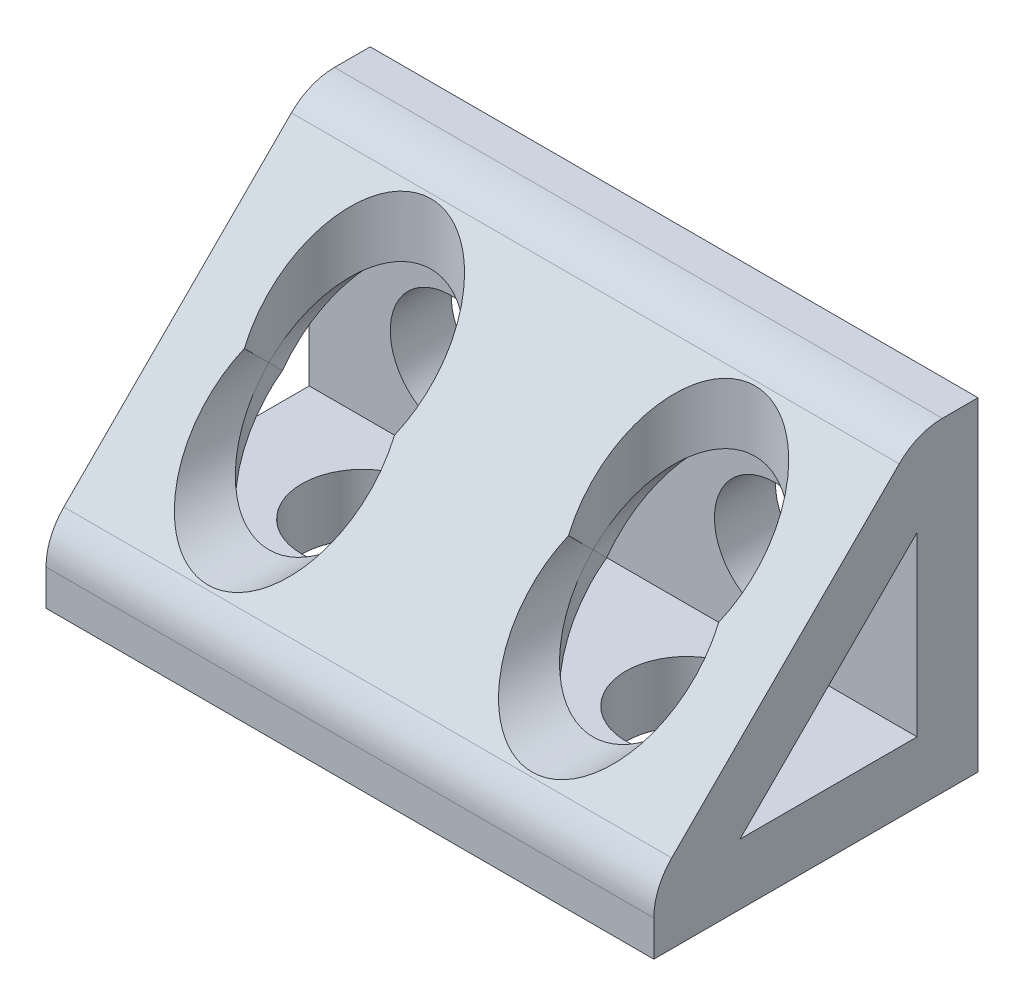
ISO-10303-21;
HEADER;
FILE_DESCRIPTION(('STEP AP214'),'2;1');
FILE_NAME('part.step','',(''),(''),'','','');
FILE_SCHEMA(('AUTOMOTIVE_DESIGN { 1 0 10303 214 1 1 1 1 }'));
ENDSEC;
DATA;
#1=APPLICATION_CONTEXT('core data for automotive mechanical design processes');
#2=APPLICATION_PROTOCOL_DEFINITION('international standard','automotive_design',2000,#1);
#3=PRODUCT_CONTEXT('',#1,'mechanical');
#4=PRODUCT('Part','Part','',(#3));
#5=PRODUCT_RELATED_PRODUCT_CATEGORY('part','',(#4));
#6=PRODUCT_DEFINITION_FORMATION('','',#4);
#7=PRODUCT_DEFINITION_CONTEXT('part definition',#1,'design');
#8=PRODUCT_DEFINITION('design','',#6,#7);
#9=PRODUCT_DEFINITION_SHAPE('','',#8);
#10=(LENGTH_UNIT() NAMED_UNIT(*) SI_UNIT(.MILLI.,.METRE.));
#11=(NAMED_UNIT(*) PLANE_ANGLE_UNIT() SI_UNIT($,.RADIAN.));
#12=(NAMED_UNIT(*) SI_UNIT($,.STERADIAN.) SOLID_ANGLE_UNIT());
#13=UNCERTAINTY_MEASURE_WITH_UNIT(LENGTH_MEASURE(1.E-05),#10,'distance_accuracy_value','');
#14=(GEOMETRIC_REPRESENTATION_CONTEXT(3) GLOBAL_UNCERTAINTY_ASSIGNED_CONTEXT((#13)) GLOBAL_UNIT_ASSIGNED_CONTEXT((#10,
#11,#12)) REPRESENTATION_CONTEXT('',''));
#15=CARTESIAN_POINT('',(0.,0.,0.));
#16=DIRECTION('',(0.,0.,1.));
#17=DIRECTION('',(1.,0.,0.));
#18=AXIS2_PLACEMENT_3D('',#15,#16,#17);
#19=CARTESIAN_POINT('',(-12.7,4.7752,12.7));
#20=DIRECTION('',(0.,-1.,0.));
#21=DIRECTION('',(0.,0.,-1.));
#22=AXIS2_PLACEMENT_3D('',#19,#20,#21);
#23=CYLINDRICAL_SURFACE('',#22,6.35);
#24=CARTESIAN_POINT('',(-12.7,10.722047396956,12.7));
#25=DIRECTION('',(0.,-0.707106781186548,-0.707106781186548));
#26=DIRECTION('',(0.,0.707106781186548,-0.707106781186548));
#27=AXIS2_PLACEMENT_3D('',#24,#25,#26);
#28=ELLIPSE('',#27,8.98025612106916,6.35);
#29=CARTESIAN_POINT('',(-14.9265457635804,4.7752,18.646847396956));
#30=VERTEX_POINT('',#29);
#31=CARTESIAN_POINT('',(-18.9725135213109,11.711023698478,11.711023698478));
#32=VERTEX_POINT('',#31);
#33=EDGE_CURVE('E732',#30,#32,#28,.T.);
#34=ORIENTED_EDGE('',*,*,#33,.T.);
#35=CARTESIAN_POINT('',(-12.7,12.7,12.7));
#36=DIRECTION('',(0.,0.707106781186548,-0.707106781186548));
#37=DIRECTION('',(0.,0.707106781186548,0.707106781186548));
#38=AXIS2_PLACEMENT_3D('',#35,#36,#37);
#39=ELLIPSE('',#38,8.98025612106916,6.35);
#40=CARTESIAN_POINT('',(-19.05,12.7,12.7));
#41=VERTEX_POINT('',#40);
#42=EDGE_CURVE('E715',#32,#41,#39,.T.);
#43=ORIENTED_EDGE('',*,*,#42,.T.);
#44=CARTESIAN_POINT('',(-12.7,12.7,12.7));
#45=DIRECTION('',(0.,0.707106781186548,0.707106781186548));
#46=DIRECTION('',(0.,0.707106781186548,-0.707106781186548));
#47=AXIS2_PLACEMENT_3D('',#44,#45,#46);
#48=ELLIPSE('',#47,8.98025612106916,6.35);
#49=CARTESIAN_POINT('',(-6.35,12.7,12.7));
#50=VERTEX_POINT('',#49);
#51=EDGE_CURVE('E723',#41,#50,#48,.T.);
#52=ORIENTED_EDGE('',*,*,#51,.T.);
#53=CARTESIAN_POINT('',(-12.7,12.7,12.7));
#54=DIRECTION('',(0.,0.707106781186548,-0.707106781186548));
#55=DIRECTION('',(0.,0.707106781186548,0.707106781186548));
#56=AXIS2_PLACEMENT_3D('',#53,#54,#55);
#57=ELLIPSE('',#56,8.98025612106916,6.35);
#58=CARTESIAN_POINT('',(-6.42748647868912,11.711023698478,11.711023698478));
#59=VERTEX_POINT('',#58);
#60=EDGE_CURVE('E717',#50,#59,#57,.T.);
#61=ORIENTED_EDGE('',*,*,#60,.T.);
#62=CARTESIAN_POINT('',(-12.7,10.722047396956,12.7));
#63=DIRECTION('',(0.,-0.707106781186548,-0.707106781186548));
#64=DIRECTION('',(0.,0.707106781186548,-0.707106781186548));
#65=AXIS2_PLACEMENT_3D('',#62,#63,#64);
#66=ELLIPSE('',#65,8.98025612106916,6.35);
#67=CARTESIAN_POINT('',(-10.4734542364196,4.7752,18.646847396956));
#68=VERTEX_POINT('',#67);
#69=EDGE_CURVE('E354',#59,#68,#66,.T.);
#70=ORIENTED_EDGE('',*,*,#69,.T.);
#71=CARTESIAN_POINT('',(-12.7,4.7752,12.7));
#72=DIRECTION('',(0.,1.,0.));
#73=DIRECTION('',(1.,0.,0.));
#74=AXIS2_PLACEMENT_3D('',#71,#72,#73);
#75=CIRCLE('',#74,6.35);
#76=EDGE_CURVE('E344',#30,#68,#75,.T.);
#77=ORIENTED_EDGE('',*,*,#76,.F.);
#78=EDGE_LOOP('',(#34,#43,#52,#61,#70,#77));
#79=FACE_BOUND('',#78,.T.);
#80=ADVANCED_FACE('F42',(#79),#23,.F.);
#81=CARTESIAN_POINT('',(23.8125,24.001376301522,6.173823698478));
#82=DIRECTION('',(0.,-0.707106781186548,-0.707106781186548));
#83=DIRECTION('',(0.,0.707106781186548,-0.707106781186548));
#84=AXIS2_PLACEMENT_3D('',#81,#82,#83);
#85=PLANE('',#84);
#86=CARTESIAN_POINT('',(-12.7,17.4752,12.7));
#87=DIRECTION('',(0.,-0.707106781186548,-0.707106781186548));
#88=DIRECTION('',(0.,0.707106781186548,-0.707106781186548));
#89=AXIS2_PLACEMENT_3D('',#86,#87,#88);
#90=ELLIPSE('',#89,8.98025612106916,6.35);
#91=CARTESIAN_POINT('',(-18.5840348605357,15.0876,15.0876));
#92=VERTEX_POINT('',#91);
#93=CARTESIAN_POINT('',(-6.81596513946425,15.0876,15.0876));
#94=VERTEX_POINT('',#93);
#95=EDGE_CURVE('E327',#92,#94,#90,.T.);
#96=ORIENTED_EDGE('',*,*,#95,.T.);
#97=CARTESIAN_POINT('',(-12.7,12.7,17.4752));
#98=DIRECTION('',(0.,-0.707106781186548,-0.707106781186548));
#99=DIRECTION('',(0.,-0.707106781186548,0.707106781186548));
#100=AXIS2_PLACEMENT_3D('',#97,#98,#99);
#101=ELLIPSE('',#100,8.98025612106916,6.35);
#102=EDGE_CURVE('E659',#94,#92,#101,.T.);
#103=ORIENTED_EDGE('',*,*,#102,.T.);
#104=EDGE_LOOP('',(#96,#103));
#105=FACE_BOUND('',#104,.T.);
#106=CARTESIAN_POINT('',(12.7,12.7,17.4752));
#107=DIRECTION('',(0.,-0.707106781186548,-0.707106781186548));
#108=DIRECTION('',(0.,-0.707106781186548,0.707106781186548));
#109=AXIS2_PLACEMENT_3D('',#106,#107,#108);
#110=ELLIPSE('',#109,8.98025612106916,6.35);
#111=CARTESIAN_POINT('',(18.5840348605357,15.0876,15.0876));
#112=VERTEX_POINT('',#111);
#113=CARTESIAN_POINT('',(6.81596513946425,15.0876,15.0876));
#114=VERTEX_POINT('',#113);
#115=EDGE_CURVE('E653',#112,#114,#110,.T.);
#116=ORIENTED_EDGE('',*,*,#115,.T.);
#117=CARTESIAN_POINT('',(12.7,17.4752,12.7));
#118=DIRECTION('',(0.,-0.707106781186548,-0.707106781186548));
#119=DIRECTION('',(0.,0.707106781186548,-0.707106781186548));
#120=AXIS2_PLACEMENT_3D('',#117,#118,#119);
#121=ELLIPSE('',#120,8.98025612106916,6.35);
#122=EDGE_CURVE('E219',#114,#112,#121,.T.);
#123=ORIENTED_EDGE('',*,*,#122,.T.);
#124=EDGE_LOOP('',(#116,#123));
#125=FACE_BOUND('',#124,.T.);
#126=DIRECTION('',(0.,-0.707106781186548,0.707106781186548));
#127=VECTOR('',#126,1.);
#128=CARTESIAN_POINT('',(23.8125,24.001376301522,6.173823698478));
#129=LINE('',#128,#127);
#130=CARTESIAN_POINT('',(23.8125,24.0013763015224,6.17382369847762));
#131=VERTEX_POINT('',#130);
#132=CARTESIAN_POINT('',(23.8125,6.17382369847761,24.0013763015224));
#133=VERTEX_POINT('',#132);
#134=EDGE_CURVE('E220',#131,#133,#129,.T.);
#135=ORIENTED_EDGE('',*,*,#134,.F.);
#136=DIRECTION('',(-1.,0.,0.));
#137=VECTOR('',#136,1.);
#138=CARTESIAN_POINT('',(23.8125,24.0013763015224,6.17382369847762));
#139=LINE('',#138,#137);
#140=CARTESIAN_POINT('',(-23.8125,24.0013763015224,6.17382369847762));
#141=VERTEX_POINT('',#140);
#142=EDGE_CURVE('E767',#131,#141,#139,.T.);
#143=ORIENTED_EDGE('',*,*,#142,.T.);
#144=DIRECTION('',(0.,-0.707106781186548,0.707106781186548));
#145=VECTOR('',#144,1.);
#146=CARTESIAN_POINT('',(-23.8125,24.001376301522,6.173823698478));
#147=LINE('',#146,#145);
#148=CARTESIAN_POINT('',(-23.8125,6.17382369847761,24.0013763015224));
#149=VERTEX_POINT('',#148);
#150=EDGE_CURVE('E214',#141,#149,#147,.T.);
#151=ORIENTED_EDGE('',*,*,#150,.T.);
#152=DIRECTION('',(-1.,0.,0.));
#153=VECTOR('',#152,1.);
#154=CARTESIAN_POINT('',(23.8125,6.17382369847762,24.0013763015224));
#155=LINE('',#154,#153);
#156=EDGE_CURVE('E746',#149,#133,#155,.F.);
#157=ORIENTED_EDGE('',*,*,#156,.T.);
#158=EDGE_LOOP('',(#135,#143,#151,#157));
#159=FACE_BOUND('',#158,.T.);
#160=ADVANCED_FACE('F682',(#105,#125,#159),#85,.F.);
#161=CARTESIAN_POINT('',(23.8125,2.79724739695653,20.6248000000013));
#162=DIRECTION('',(1.,0.,0.));
#163=DIRECTION('',(0.,0.,-1.));
#164=AXIS2_PLACEMENT_3D('',#161,#162,#163);
#165=PLANE('',#164);
#166=DIRECTION('',(0.,0.,1.));
#167=VECTOR('',#166,1.);
#168=CARTESIAN_POINT('',(23.8125,25.4,0.));
#169=LINE('',#168,#167);
#170=CARTESIAN_POINT('',(23.8125,25.4,0.));
#171=VERTEX_POINT('',#170);
#172=CARTESIAN_POINT('',(23.8125,25.4,2.79724739695653));
#173=VERTEX_POINT('',#172);
#174=EDGE_CURVE('E185',#171,#173,#169,.T.);
#175=ORIENTED_EDGE('',*,*,#174,.T.);
#176=CARTESIAN_POINT('',(23.8125,20.6248000000013,2.79724739695653));
#177=DIRECTION('',(1.,0.,0.));
#178=DIRECTION('',(0.,0.,-1.));
#179=AXIS2_PLACEMENT_3D('',#176,#177,#178);
#180=CIRCLE('',#179,4.7751999999987);
#181=EDGE_CURVE('E50',#173,#131,#180,.T.);
#182=ORIENTED_EDGE('',*,*,#181,.T.);
#183=ORIENTED_EDGE('',*,*,#134,.T.);
#184=CARTESIAN_POINT('',(23.8125,2.79724739695653,20.6248000000013));
#185=DIRECTION('',(1.,0.,0.));
#186=DIRECTION('',(0.,0.,-1.));
#187=AXIS2_PLACEMENT_3D('',#184,#185,#186);
#188=CIRCLE('',#187,4.7751999999987);
#189=CARTESIAN_POINT('',(23.8125,2.79724739695653,25.4));
#190=VERTEX_POINT('',#189);
#191=EDGE_CURVE('E57',#133,#190,#188,.T.);
#192=ORIENTED_EDGE('',*,*,#191,.T.);
#193=DIRECTION('',(0.,1.,0.));
#194=VECTOR('',#193,1.);
#195=CARTESIAN_POINT('',(23.8125,0.,25.4));
#196=LINE('',#195,#194);
#197=CARTESIAN_POINT('',(23.8125,0.,25.4));
#198=VERTEX_POINT('',#197);
#199=EDGE_CURVE('E493',#198,#190,#196,.T.);
#200=ORIENTED_EDGE('',*,*,#199,.F.);
#201=DIRECTION('',(0.,0.,1.));
#202=VECTOR('',#201,1.);
#203=CARTESIAN_POINT('',(23.8125,0.,25.4));
#204=LINE('',#203,#202);
#205=CARTESIAN_POINT('',(23.8125,0.,0.));
#206=VERTEX_POINT('',#205);
#207=EDGE_CURVE('E187',#206,#198,#204,.T.);
#208=ORIENTED_EDGE('',*,*,#207,.F.);
#209=DIRECTION('',(0.,-1.,0.));
#210=VECTOR('',#209,1.);
#211=CARTESIAN_POINT('',(23.8125,0.,0.));
#212=LINE('',#211,#210);
#213=EDGE_CURVE('E181',#171,#206,#212,.T.);
#214=ORIENTED_EDGE('',*,*,#213,.F.);
#215=EDGE_LOOP('',(#175,#182,#183,#192,#200,#208,#214));
#216=FACE_BOUND('',#215,.T.);
#217=DIRECTION('',(0.,-0.707106781186548,0.707106781186548));
#218=VECTOR('',#217,1.);
#219=CARTESIAN_POINT('',(23.8125,18.646847396956,4.7752));
#220=LINE('',#219,#218);
#221=CARTESIAN_POINT('',(23.8125,18.646847396956,4.7752));
#222=VERTEX_POINT('',#221);
#223=CARTESIAN_POINT('',(23.8125,4.7752,18.646847396956));
#224=VERTEX_POINT('',#223);
#225=EDGE_CURVE('E569',#222,#224,#220,.T.);
#226=ORIENTED_EDGE('',*,*,#225,.F.);
#227=DIRECTION('',(0.,-1.,0.));
#228=VECTOR('',#227,1.);
#229=CARTESIAN_POINT('',(23.8125,0.,4.7752));
#230=LINE('',#229,#228);
#231=CARTESIAN_POINT('',(23.8125,4.7752,4.7752));
#232=VERTEX_POINT('',#231);
#233=EDGE_CURVE('E508',#222,#232,#230,.T.);
#234=ORIENTED_EDGE('',*,*,#233,.T.);
#235=DIRECTION('',(0.,0.,1.));
#236=VECTOR('',#235,1.);
#237=CARTESIAN_POINT('',(23.8125,4.7752,25.4));
#238=LINE('',#237,#236);
#239=EDGE_CURVE('E206',#232,#224,#238,.T.);
#240=ORIENTED_EDGE('',*,*,#239,.T.);
#241=EDGE_LOOP('',(#226,#234,#240));
#242=FACE_BOUND('',#241,.T.);
#243=ADVANCED_FACE('F183',(#216,#242),#165,.T.);
#244=CARTESIAN_POINT('',(12.7,12.7,4.7752));
#245=DIRECTION('',(0.,0.,-1.));
#246=DIRECTION('',(0.,-1.,0.));
#247=AXIS2_PLACEMENT_3D('',#244,#245,#246);
#248=CYLINDRICAL_SURFACE('',#247,6.35);
#249=CARTESIAN_POINT('',(12.7,12.7,10.722047396956));
#250=DIRECTION('',(0.,-0.707106781186548,-0.707106781186548));
#251=DIRECTION('',(0.,-0.707106781186548,0.707106781186548));
#252=AXIS2_PLACEMENT_3D('',#249,#250,#251);
#253=ELLIPSE('',#252,8.98025612106916,6.35);
#254=CARTESIAN_POINT('',(14.9265457635804,18.646847396956,4.7752));
#255=VERTEX_POINT('',#254);
#256=CARTESIAN_POINT('',(18.9725135213109,11.711023698478,11.711023698478));
#257=VERTEX_POINT('',#256);
#258=EDGE_CURVE('E381',#255,#257,#253,.T.);
#259=ORIENTED_EDGE('',*,*,#258,.T.);
#260=CARTESIAN_POINT('',(12.7,12.7,12.7));
#261=DIRECTION('',(0.,-0.707106781186548,0.707106781186548));
#262=DIRECTION('',(0.,0.707106781186548,0.707106781186548));
#263=AXIS2_PLACEMENT_3D('',#260,#261,#262);
#264=ELLIPSE('',#263,8.98025612106916,6.35);
#265=CARTESIAN_POINT('',(19.05,12.7,12.7));
#266=VERTEX_POINT('',#265);
#267=EDGE_CURVE('E393',#257,#266,#264,.T.);
#268=ORIENTED_EDGE('',*,*,#267,.T.);
#269=CARTESIAN_POINT('',(12.7,12.7,12.7));
#270=DIRECTION('',(0.,0.707106781186548,0.707106781186548));
#271=DIRECTION('',(0.,-0.707106781186548,0.707106781186548));
#272=AXIS2_PLACEMENT_3D('',#269,#270,#271);
#273=ELLIPSE('',#272,8.98025612106916,6.35);
#274=CARTESIAN_POINT('',(6.35,12.7,12.7));
#275=VERTEX_POINT('',#274);
#276=EDGE_CURVE('E396',#266,#275,#273,.T.);
#277=ORIENTED_EDGE('',*,*,#276,.T.);
#278=CARTESIAN_POINT('',(12.7,12.7,12.7));
#279=DIRECTION('',(0.,-0.707106781186548,0.707106781186548));
#280=DIRECTION('',(0.,0.707106781186548,0.707106781186548));
#281=AXIS2_PLACEMENT_3D('',#278,#279,#280);
#282=ELLIPSE('',#281,8.98025612106916,6.35);
#283=CARTESIAN_POINT('',(6.42748647868912,11.711023698478,11.711023698478));
#284=VERTEX_POINT('',#283);
#285=EDGE_CURVE('E623',#275,#284,#282,.T.);
#286=ORIENTED_EDGE('',*,*,#285,.T.);
#287=CARTESIAN_POINT('',(12.7,12.7,10.722047396956));
#288=DIRECTION('',(0.,-0.707106781186548,-0.707106781186548));
#289=DIRECTION('',(0.,-0.707106781186548,0.707106781186548));
#290=AXIS2_PLACEMENT_3D('',#287,#288,#289);
#291=ELLIPSE('',#290,8.98025612106916,6.35);
#292=CARTESIAN_POINT('',(10.4734542364196,18.646847396956,4.7752));
#293=VERTEX_POINT('',#292);
#294=EDGE_CURVE('E622',#284,#293,#291,.T.);
#295=ORIENTED_EDGE('',*,*,#294,.T.);
#296=CARTESIAN_POINT('',(12.7,12.7,4.7752));
#297=DIRECTION('',(0.,0.,1.));
#298=DIRECTION('',(1.,0.,0.));
#299=AXIS2_PLACEMENT_3D('',#296,#297,#298);
#300=CIRCLE('',#299,6.35);
#301=EDGE_CURVE('E383',#255,#293,#300,.T.);
#302=ORIENTED_EDGE('',*,*,#301,.F.);
#303=EDGE_LOOP('',(#259,#268,#277,#286,#295,#302));
#304=FACE_BOUND('',#303,.T.);
#305=ADVANCED_FACE('F908',(#304),#248,.F.);
#306=CARTESIAN_POINT('',(23.8125,18.646847396956,4.7752));
#307=DIRECTION('',(0.,-0.707106781186548,-0.707106781186548));
#308=DIRECTION('',(0.,0.707106781186548,-0.707106781186548));
#309=AXIS2_PLACEMENT_3D('',#306,#307,#308);
#310=PLANE('',#309);
#311=CARTESIAN_POINT('',(-12.7,12.7,10.722047396956));
#312=DIRECTION('',(0.,-0.707106781186548,-0.707106781186548));
#313=DIRECTION('',(0.,-0.707106781186548,0.707106781186548));
#314=AXIS2_PLACEMENT_3D('',#311,#312,#313);
#315=ELLIPSE('',#314,8.98025612106916,6.35);
#316=CARTESIAN_POINT('',(-10.4734542364196,18.646847396956,4.7752));
#317=VERTEX_POINT('',#316);
#318=EDGE_CURVE('E633',#317,#59,#315,.T.);
#319=ORIENTED_EDGE('',*,*,#318,.F.);
#320=DIRECTION('',(-1.,0.,0.));
#321=VECTOR('',#320,1.);
#322=CARTESIAN_POINT('',(23.8125,18.646847396956,4.7752));
#323=LINE('',#322,#321);
#324=EDGE_CURVE('E473',#293,#317,#323,.T.);
#325=ORIENTED_EDGE('',*,*,#324,.F.);
#326=ORIENTED_EDGE('',*,*,#294,.F.);
#327=CARTESIAN_POINT('',(12.7,10.722047396956,12.7));
#328=DIRECTION('',(0.,-0.707106781186548,-0.707106781186548));
#329=DIRECTION('',(0.,0.707106781186548,-0.707106781186548));
#330=AXIS2_PLACEMENT_3D('',#327,#328,#329);
#331=ELLIPSE('',#330,8.98025612106916,6.35);
#332=CARTESIAN_POINT('',(10.4734542364196,4.7752,18.646847396956));
#333=VERTEX_POINT('',#332);
#334=EDGE_CURVE('E638',#333,#284,#331,.T.);
#335=ORIENTED_EDGE('',*,*,#334,.F.);
#336=DIRECTION('',(-1.,0.,0.));
#337=VECTOR('',#336,1.);
#338=CARTESIAN_POINT('',(23.8125,4.7752,18.646847396956));
#339=LINE('',#338,#337);
#340=EDGE_CURVE('E430',#333,#68,#339,.T.);
#341=ORIENTED_EDGE('',*,*,#340,.T.);
#342=ORIENTED_EDGE('',*,*,#69,.F.);
#343=EDGE_LOOP('',(#319,#325,#326,#335,#341,#342));
#344=FACE_BOUND('',#343,.T.);
#345=ADVANCED_FACE('F961',(#344),#310,.T.);
#346=CARTESIAN_POINT('',(12.7,4.7752,12.7));
#347=DIRECTION('',(0.,-1.,0.));
#348=DIRECTION('',(0.,0.,-1.));
#349=AXIS2_PLACEMENT_3D('',#346,#347,#348);
#350=CYLINDRICAL_SURFACE('',#349,6.35);
#351=CARTESIAN_POINT('',(12.7,12.7,12.7));
#352=DIRECTION('',(0.,0.707106781186548,0.707106781186548));
#353=DIRECTION('',(0.,-0.707106781186548,0.707106781186548));
#354=AXIS2_PLACEMENT_3D('',#351,#352,#353);
#355=ELLIPSE('',#354,8.98025612106916,6.35);
#356=EDGE_CURVE('E416',#275,#266,#355,.T.);
#357=ORIENTED_EDGE('',*,*,#356,.T.);
#358=ORIENTED_EDGE('',*,*,#267,.F.);
#359=CARTESIAN_POINT('',(12.7,10.722047396956,12.7));
#360=DIRECTION('',(0.,-0.707106781186548,-0.707106781186548));
#361=DIRECTION('',(0.,0.707106781186548,-0.707106781186548));
#362=AXIS2_PLACEMENT_3D('',#359,#360,#361);
#363=ELLIPSE('',#362,8.98025612106916,6.35);
#364=CARTESIAN_POINT('',(14.9265457635804,4.7752,18.646847396956));
#365=VERTEX_POINT('',#364);
#366=EDGE_CURVE('E414',#257,#365,#363,.T.);
#367=ORIENTED_EDGE('',*,*,#366,.T.);
#368=CARTESIAN_POINT('',(12.7,4.7752,12.7));
#369=DIRECTION('',(0.,1.,0.));
#370=DIRECTION('',(1.,0.,0.));
#371=AXIS2_PLACEMENT_3D('',#368,#369,#370);
#372=CIRCLE('',#371,6.35);
#373=EDGE_CURVE('E429',#333,#365,#372,.T.);
#374=ORIENTED_EDGE('',*,*,#373,.F.);
#375=ORIENTED_EDGE('',*,*,#334,.T.);
#376=ORIENTED_EDGE('',*,*,#285,.F.);
#377=EDGE_LOOP('',(#357,#358,#367,#374,#375,#376));
#378=FACE_BOUND('',#377,.T.);
#379=ADVANCED_FACE('F951',(#378),#350,.F.);
#380=CARTESIAN_POINT('',(23.8125,18.646847396956,4.7752));
#381=DIRECTION('',(0.,-0.707106781186548,-0.707106781186548));
#382=DIRECTION('',(0.,0.707106781186548,-0.707106781186548));
#383=AXIS2_PLACEMENT_3D('',#380,#381,#382);
#384=PLANE('',#383);
#385=ORIENTED_EDGE('',*,*,#366,.F.);
#386=ORIENTED_EDGE('',*,*,#258,.F.);
#387=DIRECTION('',(-1.,0.,0.));
#388=VECTOR('',#387,1.);
#389=CARTESIAN_POINT('',(23.8125,18.646847396956,4.7752));
#390=LINE('',#389,#388);
#391=EDGE_CURVE('E297',#222,#255,#390,.T.);
#392=ORIENTED_EDGE('',*,*,#391,.F.);
#393=ORIENTED_EDGE('',*,*,#225,.T.);
#394=DIRECTION('',(-1.,0.,0.));
#395=VECTOR('',#394,1.);
#396=CARTESIAN_POINT('',(23.8125,4.7752,18.646847396956));
#397=LINE('',#396,#395);
#398=EDGE_CURVE('E328',#224,#365,#397,.T.);
#399=ORIENTED_EDGE('',*,*,#398,.T.);
#400=EDGE_LOOP('',(#385,#386,#392,#393,#399));
#401=FACE_BOUND('',#400,.T.);
#402=ADVANCED_FACE('F946',(#401),#384,.T.);
#403=CARTESIAN_POINT('',(12.7,12.7,4.7752));
#404=DIRECTION('',(0.,0.,-1.));
#405=DIRECTION('',(0.,1.,0.));
#406=AXIS2_PLACEMENT_3D('',#403,#404,#405);
#407=CYLINDRICAL_SURFACE('',#406,6.35);
#408=ORIENTED_EDGE('',*,*,#115,.F.);
#409=CARTESIAN_POINT('',(12.7,12.7,12.7));
#410=DIRECTION('',(0.,-0.707106781186548,0.707106781186548));
#411=DIRECTION('',(0.,0.707106781186548,0.707106781186548));
#412=AXIS2_PLACEMENT_3D('',#409,#410,#411);
#413=ELLIPSE('',#412,8.98025612106916,6.35);
#414=EDGE_CURVE('E691',#266,#112,#413,.T.);
#415=ORIENTED_EDGE('',*,*,#414,.F.);
#416=ORIENTED_EDGE('',*,*,#356,.F.);
#417=CARTESIAN_POINT('',(12.7,12.7,12.7));
#418=DIRECTION('',(0.,-0.707106781186548,0.707106781186548));
#419=DIRECTION('',(0.,0.707106781186548,0.707106781186548));
#420=AXIS2_PLACEMENT_3D('',#417,#418,#419);
#421=ELLIPSE('',#420,8.98025612106916,6.35);
#422=EDGE_CURVE('E645',#114,#275,#421,.T.);
#423=ORIENTED_EDGE('',*,*,#422,.F.);
#424=EDGE_LOOP('',(#408,#415,#416,#423));
#425=FACE_BOUND('',#424,.T.);
#426=ADVANCED_FACE('F689',(#425),#407,.F.);
#427=CARTESIAN_POINT('',(12.7,4.7752,12.7));
#428=DIRECTION('',(0.,-1.,0.));
#429=DIRECTION('',(0.,0.,1.));
#430=AXIS2_PLACEMENT_3D('',#427,#428,#429);
#431=CYLINDRICAL_SURFACE('',#430,6.35);
#432=ORIENTED_EDGE('',*,*,#276,.F.);
#433=ORIENTED_EDGE('',*,*,#414,.T.);
#434=ORIENTED_EDGE('',*,*,#122,.F.);
#435=ORIENTED_EDGE('',*,*,#422,.T.);
#436=EDGE_LOOP('',(#432,#433,#434,#435));
#437=FACE_BOUND('',#436,.T.);
#438=ADVANCED_FACE('F693',(#437),#431,.F.);
#439=CARTESIAN_POINT('',(-12.7,12.7,4.7752));
#440=DIRECTION('',(0.,0.,-1.));
#441=DIRECTION('',(0.,-1.,0.));
#442=AXIS2_PLACEMENT_3D('',#439,#440,#441);
#443=CYLINDRICAL_SURFACE('',#442,6.35);
#444=CARTESIAN_POINT('',(-12.7,12.7,12.7));
#445=DIRECTION('',(0.,0.707106781186548,0.707106781186548));
#446=DIRECTION('',(0.,0.707106781186548,-0.707106781186548));
#447=AXIS2_PLACEMENT_3D('',#444,#445,#446);
#448=ELLIPSE('',#447,8.98025612106916,6.35);
#449=EDGE_CURVE('E456',#50,#41,#448,.T.);
#450=ORIENTED_EDGE('',*,*,#449,.T.);
#451=ORIENTED_EDGE('',*,*,#42,.F.);
#452=CARTESIAN_POINT('',(-12.7,12.7,10.722047396956));
#453=DIRECTION('',(0.,-0.707106781186548,-0.707106781186548));
#454=DIRECTION('',(0.,-0.707106781186548,0.707106781186548));
#455=AXIS2_PLACEMENT_3D('',#452,#453,#454);
#456=ELLIPSE('',#455,8.98025612106916,6.35);
#457=CARTESIAN_POINT('',(-14.9265457635804,18.646847396956,4.7752));
#458=VERTEX_POINT('',#457);
#459=EDGE_CURVE('E451',#32,#458,#456,.T.);
#460=ORIENTED_EDGE('',*,*,#459,.T.);
#461=CARTESIAN_POINT('',(-12.7,12.7,4.7752));
#462=DIRECTION('',(0.,0.,1.));
#463=DIRECTION('',(1.,0.,0.));
#464=AXIS2_PLACEMENT_3D('',#461,#462,#463);
#465=CIRCLE('',#464,6.35);
#466=EDGE_CURVE('E304',#317,#458,#465,.T.);
#467=ORIENTED_EDGE('',*,*,#466,.F.);
#468=ORIENTED_EDGE('',*,*,#318,.T.);
#469=ORIENTED_EDGE('',*,*,#60,.F.);
#470=EDGE_LOOP('',(#450,#451,#460,#467,#468,#469));
#471=FACE_BOUND('',#470,.T.);
#472=ADVANCED_FACE('F714',(#471),#443,.F.);
#473=CARTESIAN_POINT('',(23.8125,18.646847396956,4.7752));
#474=DIRECTION('',(0.,-0.707106781186548,-0.707106781186548));
#475=DIRECTION('',(0.,0.707106781186548,-0.707106781186548));
#476=AXIS2_PLACEMENT_3D('',#473,#474,#475);
#477=PLANE('',#476);
#478=ORIENTED_EDGE('',*,*,#459,.F.);
#479=ORIENTED_EDGE('',*,*,#33,.F.);
#480=DIRECTION('',(-1.,0.,0.));
#481=VECTOR('',#480,1.);
#482=CARTESIAN_POINT('',(23.8125,4.7752,18.646847396956));
#483=LINE('',#482,#481);
#484=CARTESIAN_POINT('',(-23.8125,4.7752,18.646847396956));
#485=VERTEX_POINT('',#484);
#486=EDGE_CURVE('E342',#30,#485,#483,.T.);
#487=ORIENTED_EDGE('',*,*,#486,.T.);
#488=DIRECTION('',(0.,-0.707106781186548,0.707106781186548));
#489=VECTOR('',#488,1.);
#490=CARTESIAN_POINT('',(-23.8125,18.646847396956,4.7752));
#491=LINE('',#490,#489);
#492=CARTESIAN_POINT('',(-23.8125,18.646847396956,4.7752));
#493=VERTEX_POINT('',#492);
#494=EDGE_CURVE('E449',#493,#485,#491,.T.);
#495=ORIENTED_EDGE('',*,*,#494,.F.);
#496=DIRECTION('',(-1.,0.,0.));
#497=VECTOR('',#496,1.);
#498=CARTESIAN_POINT('',(23.8125,18.646847396956,4.7752));
#499=LINE('',#498,#497);
#500=EDGE_CURVE('E299',#458,#493,#499,.T.);
#501=ORIENTED_EDGE('',*,*,#500,.F.);
#502=EDGE_LOOP('',(#478,#479,#487,#495,#501));
#503=FACE_BOUND('',#502,.T.);
#504=ADVANCED_FACE('F897',(#503),#477,.T.);
#505=CARTESIAN_POINT('',(-23.8125,2.79724739695653,20.6248000000013));
#506=DIRECTION('',(1.,0.,0.));
#507=DIRECTION('',(0.,0.,-1.));
#508=AXIS2_PLACEMENT_3D('',#505,#506,#507);
#509=PLANE('',#508);
#510=DIRECTION('',(0.,1.,0.));
#511=VECTOR('',#510,1.);
#512=CARTESIAN_POINT('',(-23.8125,25.4,4.7752));
#513=LINE('',#512,#511);
#514=CARTESIAN_POINT('',(-23.8125,4.7752,4.7752));
#515=VERTEX_POINT('',#514);
#516=EDGE_CURVE('E199',#515,#493,#513,.T.);
#517=ORIENTED_EDGE('',*,*,#516,.T.);
#518=ORIENTED_EDGE('',*,*,#494,.T.);
#519=DIRECTION('',(0.,0.,-1.));
#520=VECTOR('',#519,1.);
#521=CARTESIAN_POINT('',(-23.8125,4.7752,4.7752));
#522=LINE('',#521,#520);
#523=EDGE_CURVE('E497',#485,#515,#522,.T.);
#524=ORIENTED_EDGE('',*,*,#523,.T.);
#525=EDGE_LOOP('',(#517,#518,#524));
#526=FACE_BOUND('',#525,.T.);
#527=ORIENTED_EDGE('',*,*,#150,.F.);
#528=CARTESIAN_POINT('',(-23.8125,20.6248000000013,2.79724739695653));
#529=DIRECTION('',(1.,0.,0.));
#530=DIRECTION('',(0.,0.,-1.));
#531=AXIS2_PLACEMENT_3D('',#528,#529,#530);
#532=CIRCLE('',#531,4.7751999999987);
#533=CARTESIAN_POINT('',(-23.8125,25.4,2.79724739695653));
#534=VERTEX_POINT('',#533);
#535=EDGE_CURVE('E766',#141,#534,#532,.F.);
#536=ORIENTED_EDGE('',*,*,#535,.T.);
#537=DIRECTION('',(0.,0.,1.));
#538=VECTOR('',#537,1.);
#539=CARTESIAN_POINT('',(-23.8125,25.4,0.));
#540=LINE('',#539,#538);
#541=CARTESIAN_POINT('',(-23.8125,25.4,0.));
#542=VERTEX_POINT('',#541);
#543=EDGE_CURVE('E203',#542,#534,#540,.T.);
#544=ORIENTED_EDGE('',*,*,#543,.F.);
#545=DIRECTION('',(0.,1.,0.));
#546=VECTOR('',#545,1.);
#547=CARTESIAN_POINT('',(-23.8125,25.4,0.));
#548=LINE('',#547,#546);
#549=CARTESIAN_POINT('',(-23.8125,0.,0.));
#550=VERTEX_POINT('',#549);
#551=EDGE_CURVE('E197',#550,#542,#548,.T.);
#552=ORIENTED_EDGE('',*,*,#551,.F.);
#553=DIRECTION('',(0.,0.,-1.));
#554=VECTOR('',#553,1.);
#555=CARTESIAN_POINT('',(-23.8125,0.,4.7752));
#556=LINE('',#555,#554);
#557=CARTESIAN_POINT('',(-23.8125,0.,25.4));
#558=VERTEX_POINT('',#557);
#559=EDGE_CURVE('E502',#558,#550,#556,.T.);
#560=ORIENTED_EDGE('',*,*,#559,.F.);
#561=DIRECTION('',(0.,1.,0.));
#562=VECTOR('',#561,1.);
#563=CARTESIAN_POINT('',(-23.8125,0.,25.4));
#564=LINE('',#563,#562);
#565=CARTESIAN_POINT('',(-23.8125,2.79724739695653,25.4));
#566=VERTEX_POINT('',#565);
#567=EDGE_CURVE('E504',#558,#566,#564,.T.);
#568=ORIENTED_EDGE('',*,*,#567,.T.);
#569=CARTESIAN_POINT('',(-23.8125,2.79724739695653,20.6248000000013));
#570=DIRECTION('',(1.,0.,0.));
#571=DIRECTION('',(0.,0.,-1.));
#572=AXIS2_PLACEMENT_3D('',#569,#570,#571);
#573=CIRCLE('',#572,4.7751999999987);
#574=EDGE_CURVE('E764',#566,#149,#573,.F.);
#575=ORIENTED_EDGE('',*,*,#574,.T.);
#576=EDGE_LOOP('',(#527,#536,#544,#552,#560,#568,#575));
#577=FACE_BOUND('',#576,.T.);
#578=ADVANCED_FACE('F580',(#526,#577),#509,.F.);
#579=CARTESIAN_POINT('',(-12.7,4.7752,12.7));
#580=DIRECTION('',(0.,-1.,0.));
#581=DIRECTION('',(0.,0.,1.));
#582=AXIS2_PLACEMENT_3D('',#579,#580,#581);
#583=CYLINDRICAL_SURFACE('',#582,6.35);
#584=ORIENTED_EDGE('',*,*,#95,.F.);
#585=CARTESIAN_POINT('',(-12.7,12.7,12.7));
#586=DIRECTION('',(0.,0.707106781186548,-0.707106781186548));
#587=DIRECTION('',(0.,0.707106781186548,0.707106781186548));
#588=AXIS2_PLACEMENT_3D('',#585,#586,#587);
#589=ELLIPSE('',#588,8.98025612106916,6.35);
#590=EDGE_CURVE('E482',#41,#92,#589,.T.);
#591=ORIENTED_EDGE('',*,*,#590,.F.);
#592=ORIENTED_EDGE('',*,*,#449,.F.);
#593=CARTESIAN_POINT('',(-12.7,12.7,12.7));
#594=DIRECTION('',(0.,0.707106781186548,-0.707106781186548));
#595=DIRECTION('',(0.,0.707106781186548,0.707106781186548));
#596=AXIS2_PLACEMENT_3D('',#593,#594,#595);
#597=ELLIPSE('',#596,8.98025612106916,6.35);
#598=EDGE_CURVE('E486',#94,#50,#597,.T.);
#599=ORIENTED_EDGE('',*,*,#598,.F.);
#600=EDGE_LOOP('',(#584,#591,#592,#599));
#601=FACE_BOUND('',#600,.T.);
#602=ADVANCED_FACE('F721',(#601),#583,.F.);
#603=CARTESIAN_POINT('',(-12.7,12.7,4.7752));
#604=DIRECTION('',(0.,0.,-1.));
#605=DIRECTION('',(0.,1.,0.));
#606=AXIS2_PLACEMENT_3D('',#603,#604,#605);
#607=CYLINDRICAL_SURFACE('',#606,6.35);
#608=ORIENTED_EDGE('',*,*,#51,.F.);
#609=ORIENTED_EDGE('',*,*,#590,.T.);
#610=ORIENTED_EDGE('',*,*,#102,.F.);
#611=ORIENTED_EDGE('',*,*,#598,.T.);
#612=EDGE_LOOP('',(#608,#609,#610,#611));
#613=FACE_BOUND('',#612,.T.);
#614=ADVANCED_FACE('F724',(#613),#607,.F.);
#615=CARTESIAN_POINT('',(-23.8125,0.,25.4));
#616=DIRECTION('',(0.,0.,-1.));
#617=DIRECTION('',(-1.,0.,0.));
#618=AXIS2_PLACEMENT_3D('',#615,#616,#617);
#619=PLANE('',#618);
#620=ORIENTED_EDGE('',*,*,#199,.T.);
#621=DIRECTION('',(-1.,0.,0.));
#622=VECTOR('',#621,1.);
#623=CARTESIAN_POINT('',(-23.8125,2.79724739695653,25.4));
#624=LINE('',#623,#622);
#625=EDGE_CURVE('E12',#190,#566,#624,.T.);
#626=ORIENTED_EDGE('',*,*,#625,.T.);
#627=ORIENTED_EDGE('',*,*,#567,.F.);
#628=DIRECTION('',(-1.,0.,0.));
#629=VECTOR('',#628,1.);
#630=CARTESIAN_POINT('',(-23.8125,0.,25.4));
#631=LINE('',#630,#629);
#632=EDGE_CURVE('E505',#198,#558,#631,.T.);
#633=ORIENTED_EDGE('',*,*,#632,.F.);
#634=EDGE_LOOP('',(#620,#626,#627,#633));
#635=FACE_BOUND('',#634,.T.);
#636=ADVANCED_FACE('F760',(#635),#619,.F.);
#637=CARTESIAN_POINT('',(0.,0.,0.));
#638=DIRECTION('',(0.,1.,0.));
#639=DIRECTION('',(0.,0.,1.));
#640=AXIS2_PLACEMENT_3D('',#637,#638,#639);
#641=PLANE('',#640);
#642=CARTESIAN_POINT('',(-12.7,0.,11.71067));
#643=DIRECTION('',(0.,1.,0.));
#644=DIRECTION('',(0.,0.,1.));
#645=AXIS2_PLACEMENT_3D('',#642,#643,#644);
#646=CIRCLE('',#645,4.7625);
#647=CARTESIAN_POINT('',(-12.7,0.,16.47317));
#648=VERTEX_POINT('',#647);
#649=EDGE_CURVE('E523',#648,#648,#646,.T.);
#650=ORIENTED_EDGE('',*,*,#649,.T.);
#651=EDGE_LOOP('',(#650));
#652=FACE_BOUND('',#651,.T.);
#653=CARTESIAN_POINT('',(12.7,0.,11.71067));
#654=DIRECTION('',(0.,1.,0.));
#655=DIRECTION('',(0.,0.,-1.));
#656=AXIS2_PLACEMENT_3D('',#653,#654,#655);
#657=CIRCLE('',#656,4.7625);
#658=CARTESIAN_POINT('',(12.7,0.,6.94817));
#659=VERTEX_POINT('',#658);
#660=EDGE_CURVE('E534',#659,#659,#657,.T.);
#661=ORIENTED_EDGE('',*,*,#660,.T.);
#662=EDGE_LOOP('',(#661));
#663=FACE_BOUND('',#662,.T.);
#664=ORIENTED_EDGE('',*,*,#559,.T.);
#665=DIRECTION('',(-1.,0.,0.));
#666=VECTOR('',#665,1.);
#667=CARTESIAN_POINT('',(-23.8125,0.,0.));
#668=LINE('',#667,#666);
#669=EDGE_CURVE('E191',#206,#550,#668,.T.);
#670=ORIENTED_EDGE('',*,*,#669,.F.);
#671=ORIENTED_EDGE('',*,*,#207,.T.);
#672=ORIENTED_EDGE('',*,*,#632,.T.);
#673=EDGE_LOOP('',(#664,#670,#671,#672));
#674=FACE_BOUND('',#673,.T.);
#675=ADVANCED_FACE('F543',(#652,#663,#674),#641,.F.);
#676=CARTESIAN_POINT('',(0.,4.7752,0.));
#677=DIRECTION('',(0.,1.,0.));
#678=DIRECTION('',(0.,0.,1.));
#679=AXIS2_PLACEMENT_3D('',#676,#677,#678);
#680=PLANE('',#679);
#681=CARTESIAN_POINT('',(-12.7,4.7752,11.71067));
#682=DIRECTION('',(0.,1.,0.));
#683=DIRECTION('',(0.,0.,1.));
#684=AXIS2_PLACEMENT_3D('',#681,#682,#683);
#685=CIRCLE('',#684,4.7625);
#686=CARTESIAN_POINT('',(-12.7,4.7752,16.47317));
#687=VERTEX_POINT('',#686);
#688=EDGE_CURVE('E537',#687,#687,#685,.T.);
#689=ORIENTED_EDGE('',*,*,#688,.F.);
#690=EDGE_LOOP('',(#689));
#691=FACE_BOUND('',#690,.T.);
#692=CARTESIAN_POINT('',(12.7,4.7752,11.71067));
#693=DIRECTION('',(0.,1.,0.));
#694=DIRECTION('',(0.,0.,-1.));
#695=AXIS2_PLACEMENT_3D('',#692,#693,#694);
#696=CIRCLE('',#695,4.7625);
#697=CARTESIAN_POINT('',(12.7,4.7752,6.94817));
#698=VERTEX_POINT('',#697);
#699=EDGE_CURVE('E531',#698,#698,#696,.T.);
#700=ORIENTED_EDGE('',*,*,#699,.F.);
#701=EDGE_LOOP('',(#700));
#702=FACE_BOUND('',#701,.T.);
#703=ORIENTED_EDGE('',*,*,#398,.F.);
#704=ORIENTED_EDGE('',*,*,#239,.F.);
#705=DIRECTION('',(1.,0.,0.));
#706=VECTOR('',#705,1.);
#707=CARTESIAN_POINT('',(23.8125,4.7752,4.7752));
#708=LINE('',#707,#706);
#709=EDGE_CURVE('E202',#515,#232,#708,.T.);
#710=ORIENTED_EDGE('',*,*,#709,.F.);
#711=ORIENTED_EDGE('',*,*,#523,.F.);
#712=ORIENTED_EDGE('',*,*,#486,.F.);
#713=ORIENTED_EDGE('',*,*,#76,.T.);
#714=ORIENTED_EDGE('',*,*,#340,.F.);
#715=ORIENTED_EDGE('',*,*,#373,.T.);
#716=EDGE_LOOP('',(#703,#704,#710,#711,#712,#713,#714,#715));
#717=FACE_BOUND('',#716,.T.);
#718=ADVANCED_FACE('F553',(#691,#702,#717),#680,.T.);
#719=CARTESIAN_POINT('',(23.8125,25.4,0.));
#720=DIRECTION('',(0.,-1.,0.));
#721=DIRECTION('',(0.,0.,-1.));
#722=AXIS2_PLACEMENT_3D('',#719,#720,#721);
#723=PLANE('',#722);
#724=ORIENTED_EDGE('',*,*,#543,.T.);
#725=DIRECTION('',(-1.,0.,0.));
#726=VECTOR('',#725,1.);
#727=CARTESIAN_POINT('',(23.8125,25.4,2.79724739695653));
#728=LINE('',#727,#726);
#729=EDGE_CURVE('E65',#534,#173,#728,.F.);
#730=ORIENTED_EDGE('',*,*,#729,.T.);
#731=ORIENTED_EDGE('',*,*,#174,.F.);
#732=DIRECTION('',(1.,0.,0.));
#733=VECTOR('',#732,1.);
#734=CARTESIAN_POINT('',(23.8125,25.4,0.));
#735=LINE('',#734,#733);
#736=EDGE_CURVE('E192',#542,#171,#735,.T.);
#737=ORIENTED_EDGE('',*,*,#736,.F.);
#738=EDGE_LOOP('',(#724,#730,#731,#737));
#739=FACE_BOUND('',#738,.T.);
#740=ADVANCED_FACE('F201',(#739),#723,.F.);
#741=CARTESIAN_POINT('',(0.,0.,0.));
#742=DIRECTION('',(0.,0.,1.));
#743=DIRECTION('',(1.,0.,0.));
#744=AXIS2_PLACEMENT_3D('',#741,#742,#743);
#745=PLANE('',#744);
#746=CARTESIAN_POINT('',(-12.7,11.71067,0.));
#747=DIRECTION('',(0.,0.,1.));
#748=DIRECTION('',(1.,0.,0.));
#749=AXIS2_PLACEMENT_3D('',#746,#747,#748);
#750=CIRCLE('',#749,4.7625);
#751=CARTESIAN_POINT('',(-7.9375,11.71067,0.));
#752=VERTEX_POINT('',#751);
#753=EDGE_CURVE('E512',#752,#752,#750,.T.);
#754=ORIENTED_EDGE('',*,*,#753,.T.);
#755=EDGE_LOOP('',(#754));
#756=FACE_BOUND('',#755,.T.);
#757=CARTESIAN_POINT('',(12.7,11.71067,0.));
#758=DIRECTION('',(0.,0.,1.));
#759=DIRECTION('',(-1.,0.,0.));
#760=AXIS2_PLACEMENT_3D('',#757,#758,#759);
#761=CIRCLE('',#760,4.7625);
#762=CARTESIAN_POINT('',(7.9375,11.71067,0.));
#763=VERTEX_POINT('',#762);
#764=EDGE_CURVE('E522',#763,#763,#761,.T.);
#765=ORIENTED_EDGE('',*,*,#764,.T.);
#766=EDGE_LOOP('',(#765));
#767=FACE_BOUND('',#766,.T.);
#768=ORIENTED_EDGE('',*,*,#736,.T.);
#769=ORIENTED_EDGE('',*,*,#213,.T.);
#770=ORIENTED_EDGE('',*,*,#669,.T.);
#771=ORIENTED_EDGE('',*,*,#551,.T.);
#772=EDGE_LOOP('',(#768,#769,#770,#771));
#773=FACE_BOUND('',#772,.T.);
#774=ADVANCED_FACE('F195',(#756,#767,#773),#745,.F.);
#775=CARTESIAN_POINT('',(0.,0.,4.7752));
#776=DIRECTION('',(0.,0.,1.));
#777=DIRECTION('',(1.,0.,0.));
#778=AXIS2_PLACEMENT_3D('',#775,#776,#777);
#779=PLANE('',#778);
#780=CARTESIAN_POINT('',(-12.7,11.71067,4.7752));
#781=DIRECTION('',(0.,0.,1.));
#782=DIRECTION('',(1.,0.,0.));
#783=AXIS2_PLACEMENT_3D('',#780,#781,#782);
#784=CIRCLE('',#783,4.7625);
#785=CARTESIAN_POINT('',(-7.9375,11.71067,4.7752));
#786=VERTEX_POINT('',#785);
#787=EDGE_CURVE('E526',#786,#786,#784,.T.);
#788=ORIENTED_EDGE('',*,*,#787,.F.);
#789=EDGE_LOOP('',(#788));
#790=FACE_BOUND('',#789,.T.);
#791=CARTESIAN_POINT('',(12.7,11.71067,4.7752));
#792=DIRECTION('',(0.,0.,1.));
#793=DIRECTION('',(-1.,0.,0.));
#794=AXIS2_PLACEMENT_3D('',#791,#792,#793);
#795=CIRCLE('',#794,4.7625);
#796=CARTESIAN_POINT('',(7.9375,11.71067,4.7752));
#797=VERTEX_POINT('',#796);
#798=EDGE_CURVE('E519',#797,#797,#795,.T.);
#799=ORIENTED_EDGE('',*,*,#798,.F.);
#800=EDGE_LOOP('',(#799));
#801=FACE_BOUND('',#800,.T.);
#802=ORIENTED_EDGE('',*,*,#233,.F.);
#803=ORIENTED_EDGE('',*,*,#391,.T.);
#804=ORIENTED_EDGE('',*,*,#301,.T.);
#805=ORIENTED_EDGE('',*,*,#324,.T.);
#806=ORIENTED_EDGE('',*,*,#466,.T.);
#807=ORIENTED_EDGE('',*,*,#500,.T.);
#808=ORIENTED_EDGE('',*,*,#516,.F.);
#809=ORIENTED_EDGE('',*,*,#709,.T.);
#810=EDGE_LOOP('',(#802,#803,#804,#805,#806,#807,#808,#809));
#811=FACE_BOUND('',#810,.T.);
#812=ADVANCED_FACE('F572',(#790,#801,#811),#779,.T.);
#813=CARTESIAN_POINT('',(23.8125,20.6248000000013,2.79724739695653));
#814=DIRECTION('',(-1.,0.,0.));
#815=DIRECTION('',(0.,0.,1.));
#816=AXIS2_PLACEMENT_3D('',#813,#814,#815);
#817=CYLINDRICAL_SURFACE('',#816,4.7751999999987);
#818=ORIENTED_EDGE('',*,*,#181,.F.);
#819=ORIENTED_EDGE('',*,*,#729,.F.);
#820=ORIENTED_EDGE('',*,*,#535,.F.);
#821=ORIENTED_EDGE('',*,*,#142,.F.);
#822=EDGE_LOOP('',(#818,#819,#820,#821));
#823=FACE_BOUND('',#822,.T.);
#824=ADVANCED_FACE('F776',(#823),#817,.T.);
#825=CARTESIAN_POINT('',(-23.8125,2.79724739695653,20.6248000000013));
#826=DIRECTION('',(-1.,0.,0.));
#827=DIRECTION('',(0.,0.,1.));
#828=AXIS2_PLACEMENT_3D('',#825,#826,#827);
#829=CYLINDRICAL_SURFACE('',#828,4.7751999999987);
#830=ORIENTED_EDGE('',*,*,#191,.F.);
#831=ORIENTED_EDGE('',*,*,#156,.F.);
#832=ORIENTED_EDGE('',*,*,#574,.F.);
#833=ORIENTED_EDGE('',*,*,#625,.F.);
#834=EDGE_LOOP('',(#830,#831,#832,#833));
#835=FACE_BOUND('',#834,.T.);
#836=ADVANCED_FACE('F44',(#835),#829,.T.);
#837=CARTESIAN_POINT('',(12.7,11.71067,0.));
#838=DIRECTION('',(0.,0.,1.));
#839=DIRECTION('',(1.,0.,0.));
#840=AXIS2_PLACEMENT_3D('',#837,#838,#839);
#841=CYLINDRICAL_SURFACE('',#840,4.7625);
#842=ORIENTED_EDGE('',*,*,#764,.F.);
#843=EDGE_LOOP('',(#842));
#844=FACE_BOUND('',#843,.T.);
#845=ORIENTED_EDGE('',*,*,#798,.T.);
#846=EDGE_LOOP('',(#845));
#847=FACE_BOUND('',#846,.T.);
#848=ADVANCED_FACE('F799',(#844,#847),#841,.F.);
#849=CARTESIAN_POINT('',(-12.7,11.71067,0.));
#850=DIRECTION('',(0.,0.,1.));
#851=DIRECTION('',(1.,0.,0.));
#852=AXIS2_PLACEMENT_3D('',#849,#850,#851);
#853=CYLINDRICAL_SURFACE('',#852,4.7625);
#854=ORIENTED_EDGE('',*,*,#753,.F.);
#855=EDGE_LOOP('',(#854));
#856=FACE_BOUND('',#855,.T.);
#857=ORIENTED_EDGE('',*,*,#787,.T.);
#858=EDGE_LOOP('',(#857));
#859=FACE_BOUND('',#858,.T.);
#860=ADVANCED_FACE('F844',(#856,#859),#853,.F.);
#861=CARTESIAN_POINT('',(12.7,0.,11.71067));
#862=DIRECTION('',(0.,1.,0.));
#863=DIRECTION('',(0.,0.,1.));
#864=AXIS2_PLACEMENT_3D('',#861,#862,#863);
#865=CYLINDRICAL_SURFACE('',#864,4.7625);
#866=ORIENTED_EDGE('',*,*,#660,.F.);
#867=EDGE_LOOP('',(#866));
#868=FACE_BOUND('',#867,.T.);
#869=ORIENTED_EDGE('',*,*,#699,.T.);
#870=EDGE_LOOP('',(#869));
#871=FACE_BOUND('',#870,.T.);
#872=ADVANCED_FACE('F549',(#868,#871),#865,.F.);
#873=CARTESIAN_POINT('',(-12.7,0.,11.71067));
#874=DIRECTION('',(0.,1.,0.));
#875=DIRECTION('',(0.,0.,1.));
#876=AXIS2_PLACEMENT_3D('',#873,#874,#875);
#877=CYLINDRICAL_SURFACE('',#876,4.7625);
#878=ORIENTED_EDGE('',*,*,#649,.F.);
#879=EDGE_LOOP('',(#878));
#880=FACE_BOUND('',#879,.T.);
#881=ORIENTED_EDGE('',*,*,#688,.T.);
#882=EDGE_LOOP('',(#881));
#883=FACE_BOUND('',#882,.T.);
#884=ADVANCED_FACE('F546',(#880,#883),#877,.F.);
#885=CLOSED_SHELL('',(#80,#160,#243,#305,#345,#379,#402,#426,#438,#472,#504,#578,#602,#614,#636,
#675,#718,#740,#774,#812,#824,#836,#848,#860,#872,#884));
#886=MANIFOLD_SOLID_BREP('B2',#885);
#887=ADVANCED_BREP_SHAPE_REPRESENTATION('',(#18,#886),#14);
#888=SHAPE_DEFINITION_REPRESENTATION(#9,#887);
ENDSEC;
END-ISO-10303-21;
